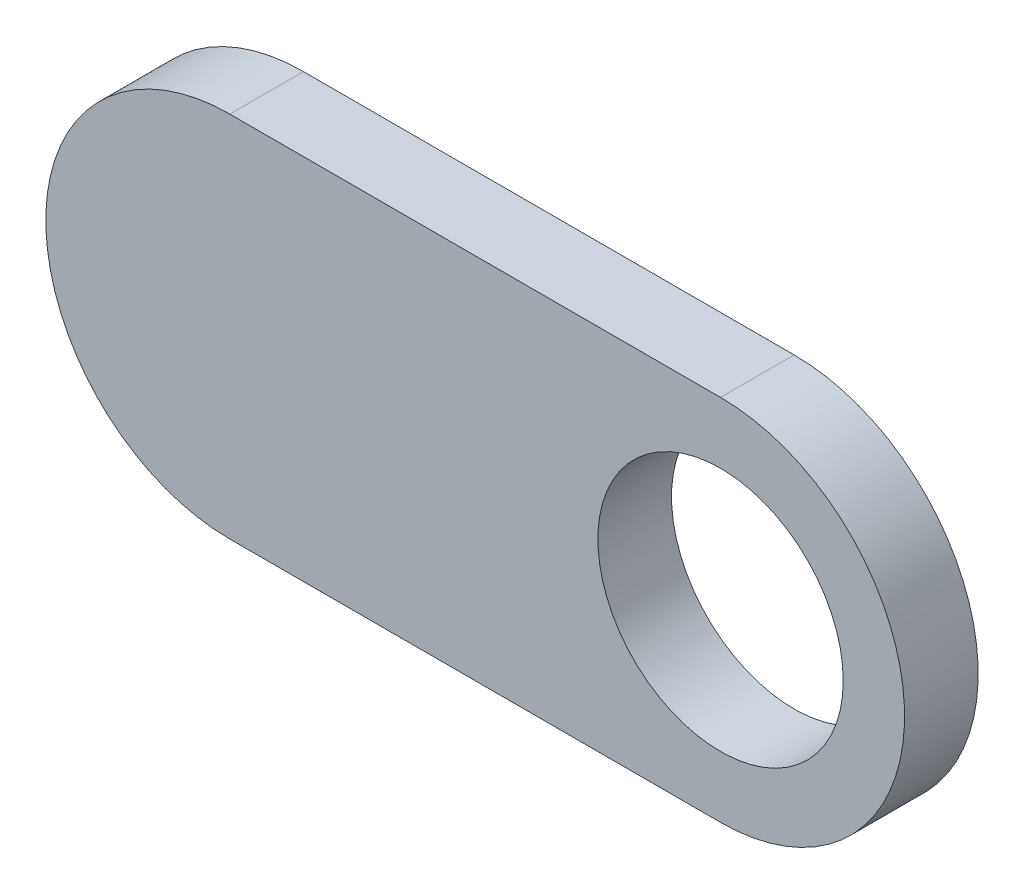
ISO-10303-21;
HEADER;
FILE_DESCRIPTION(('STEP AP214'),'2;1');
FILE_NAME('part.step','',(''),(''),'','','');
FILE_SCHEMA(('AUTOMOTIVE_DESIGN { 1 0 10303 214 1 1 1 1 }'));
ENDSEC;
DATA;
#1=APPLICATION_CONTEXT('core data for automotive mechanical design processes');
#2=APPLICATION_PROTOCOL_DEFINITION('international standard','automotive_design',2000,#1);
#3=PRODUCT_CONTEXT('',#1,'mechanical');
#4=PRODUCT('Part','Part','',(#3));
#5=PRODUCT_RELATED_PRODUCT_CATEGORY('part','',(#4));
#6=PRODUCT_DEFINITION_FORMATION('','',#4);
#7=PRODUCT_DEFINITION_CONTEXT('part definition',#1,'design');
#8=PRODUCT_DEFINITION('design','',#6,#7);
#9=PRODUCT_DEFINITION_SHAPE('','',#8);
#10=(LENGTH_UNIT() NAMED_UNIT(*) SI_UNIT(.MILLI.,.METRE.));
#11=(NAMED_UNIT(*) PLANE_ANGLE_UNIT() SI_UNIT($,.RADIAN.));
#12=(NAMED_UNIT(*) SI_UNIT($,.STERADIAN.) SOLID_ANGLE_UNIT());
#13=UNCERTAINTY_MEASURE_WITH_UNIT(LENGTH_MEASURE(1.E-05),#10,'distance_accuracy_value','');
#14=(GEOMETRIC_REPRESENTATION_CONTEXT(3) GLOBAL_UNCERTAINTY_ASSIGNED_CONTEXT((#13)) GLOBAL_UNIT_ASSIGNED_CONTEXT((#10,
#11,#12)) REPRESENTATION_CONTEXT('',''));
#15=CARTESIAN_POINT('',(0.,0.,0.));
#16=DIRECTION('',(0.,0.,1.));
#17=DIRECTION('',(1.,0.,0.));
#18=AXIS2_PLACEMENT_3D('',#15,#16,#17);
#19=CARTESIAN_POINT('',(-10.,0.,-3.));
#20=DIRECTION('',(0.,0.,1.));
#21=DIRECTION('',(1.,0.,0.));
#22=AXIS2_PLACEMENT_3D('',#19,#20,#21);
#23=CYLINDRICAL_SURFACE('',#22,7.5);
#24=CARTESIAN_POINT('',(-10.,0.,0.));
#25=DIRECTION('',(0.,0.,1.));
#26=DIRECTION('',(1.,0.,0.));
#27=AXIS2_PLACEMENT_3D('',#24,#25,#26);
#28=CIRCLE('',#27,7.5);
#29=CARTESIAN_POINT('',(-10.,7.5,0.));
#30=VERTEX_POINT('',#29);
#31=CARTESIAN_POINT('',(-10.,-7.5,0.));
#32=VERTEX_POINT('',#31);
#33=EDGE_CURVE('E102',#30,#32,#28,.T.);
#34=ORIENTED_EDGE('',*,*,#33,.F.);
#35=DIRECTION('',(0.,0.,1.));
#36=VECTOR('',#35,1.);
#37=CARTESIAN_POINT('',(-10.,7.5,-3.));
#38=LINE('',#37,#36);
#39=CARTESIAN_POINT('',(-10.,7.5,-3.));
#40=VERTEX_POINT('',#39);
#41=EDGE_CURVE('E11',#40,#30,#38,.T.);
#42=ORIENTED_EDGE('',*,*,#41,.F.);
#43=CARTESIAN_POINT('',(-10.,0.,-3.));
#44=DIRECTION('',(0.,0.,1.));
#45=DIRECTION('',(1.,0.,0.));
#46=AXIS2_PLACEMENT_3D('',#43,#44,#45);
#47=CIRCLE('',#46,7.5);
#48=CARTESIAN_POINT('',(-10.,-7.5,-3.));
#49=VERTEX_POINT('',#48);
#50=EDGE_CURVE('E95',#40,#49,#47,.T.);
#51=ORIENTED_EDGE('',*,*,#50,.T.);
#52=DIRECTION('',(0.,0.,1.));
#53=VECTOR('',#52,1.);
#54=CARTESIAN_POINT('',(-10.,-7.5,-3.));
#55=LINE('',#54,#53);
#56=EDGE_CURVE('E40',#49,#32,#55,.T.);
#57=ORIENTED_EDGE('',*,*,#56,.T.);
#58=EDGE_LOOP('',(#34,#42,#51,#57));
#59=FACE_BOUND('',#58,.T.);
#60=ADVANCED_FACE('F37',(#59),#23,.T.);
#61=CARTESIAN_POINT('',(-10.,7.5,-3.));
#62=DIRECTION('',(0.,1.,0.));
#63=DIRECTION('',(-1.,0.,0.));
#64=AXIS2_PLACEMENT_3D('',#61,#62,#63);
#65=PLANE('',#64);
#66=DIRECTION('',(-1.,0.,0.));
#67=VECTOR('',#66,1.);
#68=CARTESIAN_POINT('',(-10.,7.5,0.));
#69=LINE('',#68,#67);
#70=CARTESIAN_POINT('',(10.,7.50000000000001,0.));
#71=VERTEX_POINT('',#70);
#72=EDGE_CURVE('E97',#71,#30,#69,.T.);
#73=ORIENTED_EDGE('',*,*,#72,.F.);
#74=DIRECTION('',(0.,0.,1.));
#75=VECTOR('',#74,1.);
#76=CARTESIAN_POINT('',(10.,7.50000000000001,-3.));
#77=LINE('',#76,#75);
#78=CARTESIAN_POINT('',(10.,7.50000000000001,-3.));
#79=VERTEX_POINT('',#78);
#80=EDGE_CURVE('E46',#79,#71,#77,.T.);
#81=ORIENTED_EDGE('',*,*,#80,.F.);
#82=DIRECTION('',(-1.,0.,0.));
#83=VECTOR('',#82,1.);
#84=CARTESIAN_POINT('',(-10.,7.5,-3.));
#85=LINE('',#84,#83);
#86=EDGE_CURVE('E92',#79,#40,#85,.T.);
#87=ORIENTED_EDGE('',*,*,#86,.T.);
#88=ORIENTED_EDGE('',*,*,#41,.T.);
#89=EDGE_LOOP('',(#73,#81,#87,#88));
#90=FACE_BOUND('',#89,.T.);
#91=ADVANCED_FACE('F113',(#90),#65,.T.);
#92=CARTESIAN_POINT('',(10.,0.,-3.));
#93=DIRECTION('',(0.,0.,1.));
#94=DIRECTION('',(1.,0.,0.));
#95=AXIS2_PLACEMENT_3D('',#92,#93,#94);
#96=CYLINDRICAL_SURFACE('',#95,7.5);
#97=CARTESIAN_POINT('',(10.,0.,0.));
#98=DIRECTION('',(0.,0.,1.));
#99=DIRECTION('',(1.,0.,0.));
#100=AXIS2_PLACEMENT_3D('',#97,#98,#99);
#101=CIRCLE('',#100,7.5);
#102=CARTESIAN_POINT('',(10.,-7.5,0.));
#103=VERTEX_POINT('',#102);
#104=EDGE_CURVE('E87',#103,#71,#101,.T.);
#105=ORIENTED_EDGE('',*,*,#104,.F.);
#106=DIRECTION('',(0.,0.,1.));
#107=VECTOR('',#106,1.);
#108=CARTESIAN_POINT('',(10.,-7.5,-3.));
#109=LINE('',#108,#107);
#110=CARTESIAN_POINT('',(10.,-7.5,-3.));
#111=VERTEX_POINT('',#110);
#112=EDGE_CURVE('E82',#111,#103,#109,.T.);
#113=ORIENTED_EDGE('',*,*,#112,.F.);
#114=CARTESIAN_POINT('',(10.,0.,-3.));
#115=DIRECTION('',(0.,0.,1.));
#116=DIRECTION('',(1.,0.,0.));
#117=AXIS2_PLACEMENT_3D('',#114,#115,#116);
#118=CIRCLE('',#117,7.5);
#119=EDGE_CURVE('E85',#111,#79,#118,.T.);
#120=ORIENTED_EDGE('',*,*,#119,.T.);
#121=ORIENTED_EDGE('',*,*,#80,.T.);
#122=EDGE_LOOP('',(#105,#113,#120,#121));
#123=FACE_BOUND('',#122,.T.);
#124=ADVANCED_FACE('F84',(#123),#96,.T.);
#125=CARTESIAN_POINT('',(-10.,-7.5,-3.));
#126=DIRECTION('',(0.,-1.,0.));
#127=DIRECTION('',(1.,0.,0.));
#128=AXIS2_PLACEMENT_3D('',#125,#126,#127);
#129=PLANE('',#128);
#130=DIRECTION('',(1.,0.,0.));
#131=VECTOR('',#130,1.);
#132=CARTESIAN_POINT('',(-10.,-7.5,0.));
#133=LINE('',#132,#131);
#134=EDGE_CURVE('E105',#32,#103,#133,.T.);
#135=ORIENTED_EDGE('',*,*,#134,.F.);
#136=ORIENTED_EDGE('',*,*,#56,.F.);
#137=DIRECTION('',(1.,0.,0.));
#138=VECTOR('',#137,1.);
#139=CARTESIAN_POINT('',(-10.,-7.5,-3.));
#140=LINE('',#139,#138);
#141=EDGE_CURVE('E91',#49,#111,#140,.T.);
#142=ORIENTED_EDGE('',*,*,#141,.T.);
#143=ORIENTED_EDGE('',*,*,#112,.T.);
#144=EDGE_LOOP('',(#135,#136,#142,#143));
#145=FACE_BOUND('',#144,.T.);
#146=ADVANCED_FACE('F94',(#145),#129,.T.);
#147=CARTESIAN_POINT('',(-10.,0.,-3.));
#148=DIRECTION('',(0.,0.,1.));
#149=DIRECTION('',(1.,0.,0.));
#150=AXIS2_PLACEMENT_3D('',#147,#148,#149);
#151=PLANE('',#150);
#152=CARTESIAN_POINT('',(10.,0.,-3.));
#153=DIRECTION('',(0.,0.,1.));
#154=DIRECTION('',(1.,0.,0.));
#155=AXIS2_PLACEMENT_3D('',#152,#153,#154);
#156=CIRCLE('',#155,5.);
#157=CARTESIAN_POINT('',(15.,0.,-3.));
#158=VERTEX_POINT('',#157);
#159=EDGE_CURVE('E106',#158,#158,#156,.T.);
#160=ORIENTED_EDGE('',*,*,#159,.T.);
#161=EDGE_LOOP('',(#160));
#162=FACE_BOUND('',#161,.T.);
#163=ORIENTED_EDGE('',*,*,#50,.F.);
#164=ORIENTED_EDGE('',*,*,#86,.F.);
#165=ORIENTED_EDGE('',*,*,#119,.F.);
#166=ORIENTED_EDGE('',*,*,#141,.F.);
#167=EDGE_LOOP('',(#163,#164,#165,#166));
#168=FACE_BOUND('',#167,.T.);
#169=ADVANCED_FACE('F90',(#162,#168),#151,.F.);
#170=CARTESIAN_POINT('',(-10.,0.,0.));
#171=DIRECTION('',(0.,0.,1.));
#172=DIRECTION('',(1.,0.,0.));
#173=AXIS2_PLACEMENT_3D('',#170,#171,#172);
#174=PLANE('',#173);
#175=CARTESIAN_POINT('',(10.,0.,0.));
#176=DIRECTION('',(0.,0.,1.));
#177=DIRECTION('',(1.,0.,0.));
#178=AXIS2_PLACEMENT_3D('',#175,#176,#177);
#179=CIRCLE('',#178,5.);
#180=CARTESIAN_POINT('',(15.,0.,0.));
#181=VERTEX_POINT('',#180);
#182=EDGE_CURVE('E143',#181,#181,#179,.T.);
#183=ORIENTED_EDGE('',*,*,#182,.F.);
#184=EDGE_LOOP('',(#183));
#185=FACE_BOUND('',#184,.T.);
#186=ORIENTED_EDGE('',*,*,#33,.T.);
#187=ORIENTED_EDGE('',*,*,#134,.T.);
#188=ORIENTED_EDGE('',*,*,#104,.T.);
#189=ORIENTED_EDGE('',*,*,#72,.T.);
#190=EDGE_LOOP('',(#186,#187,#188,#189));
#191=FACE_BOUND('',#190,.T.);
#192=ADVANCED_FACE('F112',(#185,#191),#174,.T.);
#193=CARTESIAN_POINT('',(10.,0.,-3.));
#194=DIRECTION('',(0.,0.,1.));
#195=DIRECTION('',(1.,0.,0.));
#196=AXIS2_PLACEMENT_3D('',#193,#194,#195);
#197=CYLINDRICAL_SURFACE('',#196,5.);
#198=ORIENTED_EDGE('',*,*,#159,.F.);
#199=EDGE_LOOP('',(#198));
#200=FACE_BOUND('',#199,.T.);
#201=ORIENTED_EDGE('',*,*,#182,.T.);
#202=EDGE_LOOP('',(#201));
#203=FACE_BOUND('',#202,.T.);
#204=ADVANCED_FACE('F131',(#200,#203),#197,.F.);
#205=CLOSED_SHELL('',(#60,#91,#124,#146,#169,#192,#204));
#206=MANIFOLD_SOLID_BREP('B2',#205);
#207=ADVANCED_BREP_SHAPE_REPRESENTATION('',(#18,#206),#14);
#208=SHAPE_DEFINITION_REPRESENTATION(#9,#207);
ENDSEC;
END-ISO-10303-21;
